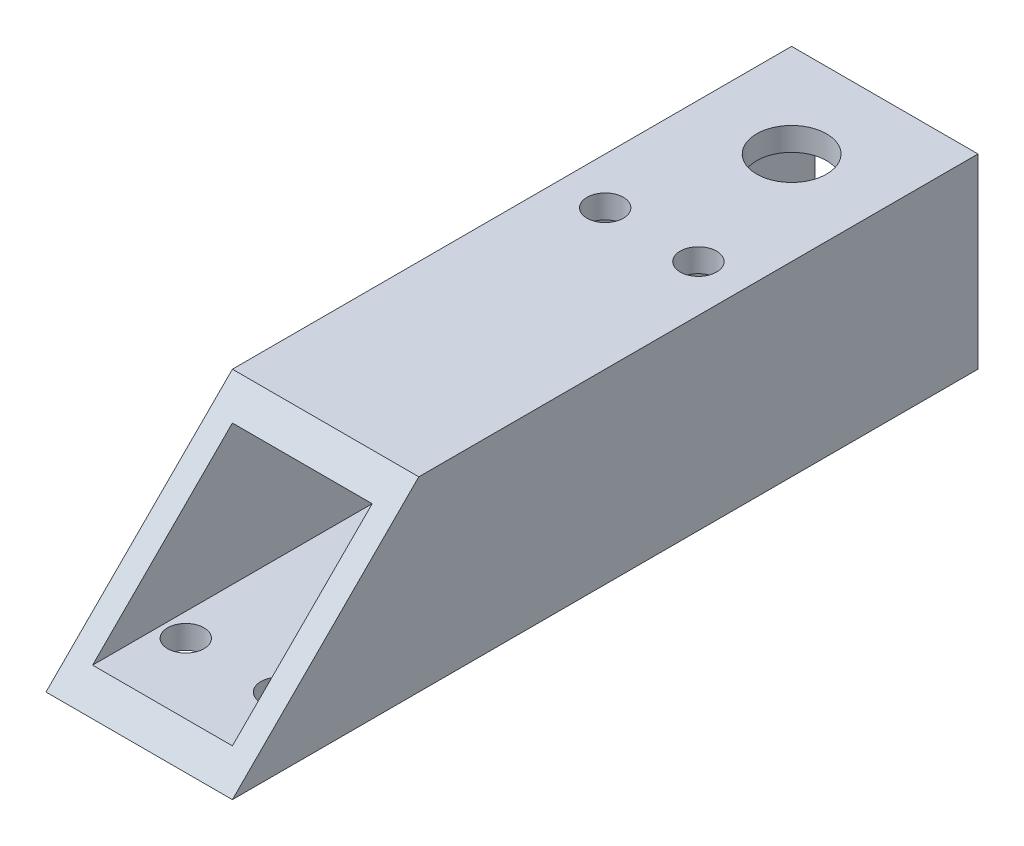
ISO-10303-21;
HEADER;
FILE_DESCRIPTION(('STEP AP214'),'2;1');
FILE_NAME('part.step','',(''),(''),'','','');
FILE_SCHEMA(('AUTOMOTIVE_DESIGN { 1 0 10303 214 1 1 1 1 }'));
ENDSEC;
DATA;
#1=APPLICATION_CONTEXT('core data for automotive mechanical design processes');
#2=APPLICATION_PROTOCOL_DEFINITION('international standard','automotive_design',2000,#1);
#3=PRODUCT_CONTEXT('',#1,'mechanical');
#4=PRODUCT('Part','Part','',(#3));
#5=PRODUCT_RELATED_PRODUCT_CATEGORY('part','',(#4));
#6=PRODUCT_DEFINITION_FORMATION('','',#4);
#7=PRODUCT_DEFINITION_CONTEXT('part definition',#1,'design');
#8=PRODUCT_DEFINITION('design','',#6,#7);
#9=PRODUCT_DEFINITION_SHAPE('','',#8);
#10=(LENGTH_UNIT() NAMED_UNIT(*) SI_UNIT(.MILLI.,.METRE.));
#11=(NAMED_UNIT(*) PLANE_ANGLE_UNIT() SI_UNIT($,.RADIAN.));
#12=(NAMED_UNIT(*) SI_UNIT($,.STERADIAN.) SOLID_ANGLE_UNIT());
#13=UNCERTAINTY_MEASURE_WITH_UNIT(LENGTH_MEASURE(1.E-05),#10,'distance_accuracy_value','');
#14=(GEOMETRIC_REPRESENTATION_CONTEXT(3) GLOBAL_UNCERTAINTY_ASSIGNED_CONTEXT((#13)) GLOBAL_UNIT_ASSIGNED_CONTEXT((#10,
#11,#12)) REPRESENTATION_CONTEXT('',''));
#15=CARTESIAN_POINT('',(0.,0.,0.));
#16=DIRECTION('',(0.,0.,1.));
#17=DIRECTION('',(1.,0.,0.));
#18=AXIS2_PLACEMENT_3D('',#15,#16,#17);
#19=CARTESIAN_POINT('',(-12.7,12.7,101.6));
#20=DIRECTION('',(0.,1.,0.));
#21=DIRECTION('',(0.,0.,1.));
#22=AXIS2_PLACEMENT_3D('',#19,#20,#21);
#23=PLANE('',#22);
#24=CARTESIAN_POINT('',(6.35,12.7,31.75));
#25=DIRECTION('',(0.,-1.,0.));
#26=DIRECTION('',(0.,0.,-1.));
#27=AXIS2_PLACEMENT_3D('',#24,#25,#26);
#28=CIRCLE('',#27,2.47650000000001);
#29=CARTESIAN_POINT('',(6.35,12.7,29.2735));
#30=VERTEX_POINT('',#29);
#31=EDGE_CURVE('E145',#30,#30,#28,.T.);
#32=ORIENTED_EDGE('',*,*,#31,.T.);
#33=EDGE_LOOP('',(#32));
#34=FACE_BOUND('',#33,.T.);
#35=CARTESIAN_POINT('',(-6.35,12.7,31.75));
#36=DIRECTION('',(0.,-1.,0.));
#37=DIRECTION('',(0.,0.,-1.));
#38=AXIS2_PLACEMENT_3D('',#35,#36,#37);
#39=CIRCLE('',#38,2.4765);
#40=CARTESIAN_POINT('',(-6.35,12.7,29.2735));
#41=VERTEX_POINT('',#40);
#42=EDGE_CURVE('E156',#41,#41,#39,.T.);
#43=ORIENTED_EDGE('',*,*,#42,.T.);
#44=EDGE_LOOP('',(#43));
#45=FACE_BOUND('',#44,.T.);
#46=CARTESIAN_POINT('',(0.,12.7,12.7));
#47=DIRECTION('',(0.,1.,0.));
#48=DIRECTION('',(0.,0.,1.));
#49=AXIS2_PLACEMENT_3D('',#46,#47,#48);
#50=CIRCLE('',#49,4.7625);
#51=CARTESIAN_POINT('',(0.,12.7,17.4625));
#52=VERTEX_POINT('',#51);
#53=EDGE_CURVE('E167',#52,#52,#50,.T.);
#54=ORIENTED_EDGE('',*,*,#53,.F.);
#55=EDGE_LOOP('',(#54));
#56=FACE_BOUND('',#55,.T.);
#57=DIRECTION('',(1.,0.,0.));
#58=VECTOR('',#57,1.);
#59=CARTESIAN_POINT('',(-12.7,12.7,76.2));
#60=LINE('',#59,#58);
#61=CARTESIAN_POINT('',(-12.7,12.7,76.2));
#62=VERTEX_POINT('',#61);
#63=CARTESIAN_POINT('',(12.7,12.7,76.2));
#64=VERTEX_POINT('',#63);
#65=EDGE_CURVE('E98',#62,#64,#60,.T.);
#66=ORIENTED_EDGE('',*,*,#65,.T.);
#67=DIRECTION('',(0.,0.,-1.));
#68=VECTOR('',#67,1.);
#69=CARTESIAN_POINT('',(12.7,12.7,101.6));
#70=LINE('',#69,#68);
#71=CARTESIAN_POINT('',(12.7,12.7,0.));
#72=VERTEX_POINT('',#71);
#73=EDGE_CURVE('E128',#64,#72,#70,.T.);
#74=ORIENTED_EDGE('',*,*,#73,.T.);
#75=DIRECTION('',(1.,0.,0.));
#76=VECTOR('',#75,1.);
#77=CARTESIAN_POINT('',(-12.7,12.7,0.));
#78=LINE('',#77,#76);
#79=CARTESIAN_POINT('',(-12.7,12.7,0.));
#80=VERTEX_POINT('',#79);
#81=EDGE_CURVE('E117',#80,#72,#78,.T.);
#82=ORIENTED_EDGE('',*,*,#81,.F.);
#83=DIRECTION('',(0.,0.,-1.));
#84=VECTOR('',#83,1.);
#85=CARTESIAN_POINT('',(-12.7,12.7,101.6));
#86=LINE('',#85,#84);
#87=EDGE_CURVE('E41',#62,#80,#86,.T.);
#88=ORIENTED_EDGE('',*,*,#87,.F.);
#89=EDGE_LOOP('',(#66,#74,#82,#88));
#90=FACE_BOUND('',#89,.T.);
#91=ADVANCED_FACE('F33',(#34,#45,#56,#90),#23,.T.);
#92=CARTESIAN_POINT('',(-12.7,-12.7,101.6));
#93=DIRECTION('',(-1.,0.,0.));
#94=DIRECTION('',(0.,0.,1.));
#95=AXIS2_PLACEMENT_3D('',#92,#93,#94);
#96=PLANE('',#95);
#97=DIRECTION('',(0.,0.707106781186547,-0.707106781186548));
#98=VECTOR('',#97,1.);
#99=CARTESIAN_POINT('',(-12.7,12.7,76.2));
#100=LINE('',#99,#98);
#101=CARTESIAN_POINT('',(-12.7,-12.7,101.6));
#102=VERTEX_POINT('',#101);
#103=EDGE_CURVE('E101',#102,#62,#100,.T.);
#104=ORIENTED_EDGE('',*,*,#103,.T.);
#105=ORIENTED_EDGE('',*,*,#87,.T.);
#106=DIRECTION('',(0.,1.,0.));
#107=VECTOR('',#106,1.);
#108=CARTESIAN_POINT('',(-12.7,-12.7,0.));
#109=LINE('',#108,#107);
#110=CARTESIAN_POINT('',(-12.7,-12.7,0.));
#111=VERTEX_POINT('',#110);
#112=EDGE_CURVE('E123',#111,#80,#109,.T.);
#113=ORIENTED_EDGE('',*,*,#112,.F.);
#114=DIRECTION('',(0.,0.,-1.));
#115=VECTOR('',#114,1.);
#116=CARTESIAN_POINT('',(-12.7,-12.7,101.6));
#117=LINE('',#116,#115);
#118=EDGE_CURVE('E113',#102,#111,#117,.T.);
#119=ORIENTED_EDGE('',*,*,#118,.F.);
#120=EDGE_LOOP('',(#104,#105,#113,#119));
#121=FACE_BOUND('',#120,.T.);
#122=ADVANCED_FACE('F110',(#121),#96,.T.);
#123=CARTESIAN_POINT('',(-12.7,-12.7,101.6));
#124=DIRECTION('',(0.,1.,0.));
#125=DIRECTION('',(0.,0.,1.));
#126=AXIS2_PLACEMENT_3D('',#123,#124,#125);
#127=PLANE('',#126);
#128=CARTESIAN_POINT('',(6.35,-12.7,31.75));
#129=DIRECTION('',(0.,-1.,0.));
#130=DIRECTION('',(0.,0.,-1.));
#131=AXIS2_PLACEMENT_3D('',#128,#129,#130);
#132=CIRCLE('',#131,2.47650000000001);
#133=CARTESIAN_POINT('',(6.35,-12.7,29.2735));
#134=VERTEX_POINT('',#133);
#135=EDGE_CURVE('E151',#134,#134,#132,.T.);
#136=ORIENTED_EDGE('',*,*,#135,.F.);
#137=EDGE_LOOP('',(#136));
#138=FACE_BOUND('',#137,.T.);
#139=CARTESIAN_POINT('',(-6.35,-12.7,31.75));
#140=DIRECTION('',(0.,-1.,0.));
#141=DIRECTION('',(0.,0.,-1.));
#142=AXIS2_PLACEMENT_3D('',#139,#140,#141);
#143=CIRCLE('',#142,2.4765);
#144=CARTESIAN_POINT('',(-6.35,-12.7,29.2735));
#145=VERTEX_POINT('',#144);
#146=EDGE_CURVE('E161',#145,#145,#143,.T.);
#147=ORIENTED_EDGE('',*,*,#146,.F.);
#148=EDGE_LOOP('',(#147));
#149=FACE_BOUND('',#148,.T.);
#150=CARTESIAN_POINT('',(0.,-12.7,12.7));
#151=DIRECTION('',(0.,1.,0.));
#152=DIRECTION('',(0.,0.,1.));
#153=AXIS2_PLACEMENT_3D('',#150,#151,#152);
#154=CIRCLE('',#153,4.7625);
#155=CARTESIAN_POINT('',(0.,-12.7,17.4625));
#156=VERTEX_POINT('',#155);
#157=EDGE_CURVE('E141',#156,#156,#154,.T.);
#158=ORIENTED_EDGE('',*,*,#157,.T.);
#159=EDGE_LOOP('',(#158));
#160=FACE_BOUND('',#159,.T.);
#161=CARTESIAN_POINT('',(-6.35,-12.7,88.9));
#162=DIRECTION('',(0.,-1.,0.));
#163=DIRECTION('',(0.,0.,-1.));
#164=AXIS2_PLACEMENT_3D('',#161,#162,#163);
#165=CIRCLE('',#164,2.4765);
#166=CARTESIAN_POINT('',(-6.35,-12.7,86.4235));
#167=VERTEX_POINT('',#166);
#168=EDGE_CURVE('E135',#167,#167,#165,.T.);
#169=ORIENTED_EDGE('',*,*,#168,.F.);
#170=EDGE_LOOP('',(#169));
#171=FACE_BOUND('',#170,.T.);
#172=CARTESIAN_POINT('',(6.35,-12.7,88.9));
#173=DIRECTION('',(0.,-1.,0.));
#174=DIRECTION('',(0.,0.,1.));
#175=AXIS2_PLACEMENT_3D('',#172,#173,#174);
#176=CIRCLE('',#175,2.4765);
#177=CARTESIAN_POINT('',(6.35,-12.7,91.3765));
#178=VERTEX_POINT('',#177);
#179=EDGE_CURVE('E174',#178,#178,#176,.T.);
#180=ORIENTED_EDGE('',*,*,#179,.F.);
#181=EDGE_LOOP('',(#180));
#182=FACE_BOUND('',#181,.T.);
#183=DIRECTION('',(1.,0.,0.));
#184=VECTOR('',#183,1.);
#185=CARTESIAN_POINT('',(-12.7,-12.7,0.));
#186=LINE('',#185,#184);
#187=CARTESIAN_POINT('',(12.7,-12.7,0.));
#188=VERTEX_POINT('',#187);
#189=EDGE_CURVE('E212',#111,#188,#186,.T.);
#190=ORIENTED_EDGE('',*,*,#189,.T.);
#191=DIRECTION('',(0.,0.,-1.));
#192=VECTOR('',#191,1.);
#193=CARTESIAN_POINT('',(12.7,-12.7,101.6));
#194=LINE('',#193,#192);
#195=CARTESIAN_POINT('',(12.7,-12.7,101.6));
#196=VERTEX_POINT('',#195);
#197=EDGE_CURVE('E120',#196,#188,#194,.T.);
#198=ORIENTED_EDGE('',*,*,#197,.F.);
#199=DIRECTION('',(1.,0.,0.));
#200=VECTOR('',#199,1.);
#201=CARTESIAN_POINT('',(-12.7,-12.7,101.6));
#202=LINE('',#201,#200);
#203=EDGE_CURVE('E129',#102,#196,#202,.T.);
#204=ORIENTED_EDGE('',*,*,#203,.F.);
#205=ORIENTED_EDGE('',*,*,#118,.T.);
#206=EDGE_LOOP('',(#190,#198,#204,#205));
#207=FACE_BOUND('',#206,.T.);
#208=ADVANCED_FACE('F221',(#138,#149,#160,#171,#182,#207),#127,.F.);
#209=CARTESIAN_POINT('',(12.7,-12.7,101.6));
#210=DIRECTION('',(-1.,0.,0.));
#211=DIRECTION('',(0.,0.,1.));
#212=AXIS2_PLACEMENT_3D('',#209,#210,#211);
#213=PLANE('',#212);
#214=ORIENTED_EDGE('',*,*,#73,.F.);
#215=DIRECTION('',(0.,0.707106781186547,-0.707106781186548));
#216=VECTOR('',#215,1.);
#217=CARTESIAN_POINT('',(12.7,12.7,76.2));
#218=LINE('',#217,#216);
#219=EDGE_CURVE('E104',#196,#64,#218,.T.);
#220=ORIENTED_EDGE('',*,*,#219,.F.);
#221=ORIENTED_EDGE('',*,*,#197,.T.);
#222=DIRECTION('',(0.,1.,0.));
#223=VECTOR('',#222,1.);
#224=CARTESIAN_POINT('',(12.7,-12.7,0.));
#225=LINE('',#224,#223);
#226=EDGE_CURVE('E210',#188,#72,#225,.T.);
#227=ORIENTED_EDGE('',*,*,#226,.T.);
#228=EDGE_LOOP('',(#214,#220,#221,#227));
#229=FACE_BOUND('',#228,.T.);
#230=ADVANCED_FACE('F220',(#229),#213,.F.);
#231=CARTESIAN_POINT('',(0.,0.,0.));
#232=DIRECTION('',(0.,0.,1.));
#233=DIRECTION('',(1.,0.,0.));
#234=AXIS2_PLACEMENT_3D('',#231,#232,#233);
#235=PLANE('',#234);
#236=DIRECTION('',(1.,0.,0.));
#237=VECTOR('',#236,1.);
#238=CARTESIAN_POINT('',(-9.525,-9.525,0.));
#239=LINE('',#238,#237);
#240=CARTESIAN_POINT('',(-9.525,-9.525,0.));
#241=VERTEX_POINT('',#240);
#242=CARTESIAN_POINT('',(9.525,-9.525,0.));
#243=VERTEX_POINT('',#242);
#244=EDGE_CURVE('E194',#241,#243,#239,.T.);
#245=ORIENTED_EDGE('',*,*,#244,.T.);
#246=DIRECTION('',(0.,1.,0.));
#247=VECTOR('',#246,1.);
#248=CARTESIAN_POINT('',(9.525,-9.525,0.));
#249=LINE('',#248,#247);
#250=CARTESIAN_POINT('',(9.525,9.525,0.));
#251=VERTEX_POINT('',#250);
#252=EDGE_CURVE('E187',#243,#251,#249,.T.);
#253=ORIENTED_EDGE('',*,*,#252,.T.);
#254=DIRECTION('',(-1.,0.,0.));
#255=VECTOR('',#254,1.);
#256=CARTESIAN_POINT('',(-9.525,9.525,0.));
#257=LINE('',#256,#255);
#258=CARTESIAN_POINT('',(-9.525,9.525,0.));
#259=VERTEX_POINT('',#258);
#260=EDGE_CURVE('E190',#251,#259,#257,.T.);
#261=ORIENTED_EDGE('',*,*,#260,.T.);
#262=DIRECTION('',(0.,-1.,0.));
#263=VECTOR('',#262,1.);
#264=CARTESIAN_POINT('',(-9.525,-9.525,0.));
#265=LINE('',#264,#263);
#266=EDGE_CURVE('E56',#259,#241,#265,.T.);
#267=ORIENTED_EDGE('',*,*,#266,.T.);
#268=EDGE_LOOP('',(#245,#253,#261,#267));
#269=FACE_BOUND('',#268,.T.);
#270=ORIENTED_EDGE('',*,*,#81,.T.);
#271=ORIENTED_EDGE('',*,*,#226,.F.);
#272=ORIENTED_EDGE('',*,*,#189,.F.);
#273=ORIENTED_EDGE('',*,*,#112,.T.);
#274=EDGE_LOOP('',(#270,#271,#272,#273));
#275=FACE_BOUND('',#274,.T.);
#276=ADVANCED_FACE('F217',(#269,#275),#235,.F.);
#277=CARTESIAN_POINT('',(9.525,-9.525,0.));
#278=DIRECTION('',(1.,0.,0.));
#279=DIRECTION('',(0.,0.,-1.));
#280=AXIS2_PLACEMENT_3D('',#277,#278,#279);
#281=PLANE('',#280);
#282=DIRECTION('',(0.,0.,1.));
#283=VECTOR('',#282,1.);
#284=CARTESIAN_POINT('',(9.525,-9.525,0.));
#285=LINE('',#284,#283);
#286=CARTESIAN_POINT('',(9.525,-9.525,98.425));
#287=VERTEX_POINT('',#286);
#288=EDGE_CURVE('E198',#243,#287,#285,.T.);
#289=ORIENTED_EDGE('',*,*,#288,.T.);
#290=DIRECTION('',(0.,0.707106781186547,-0.707106781186548));
#291=VECTOR('',#290,1.);
#292=CARTESIAN_POINT('',(9.525,39.6875,49.2125));
#293=LINE('',#292,#291);
#294=CARTESIAN_POINT('',(9.525,9.525,79.375));
#295=VERTEX_POINT('',#294);
#296=EDGE_CURVE('E184',#287,#295,#293,.T.);
#297=ORIENTED_EDGE('',*,*,#296,.T.);
#298=DIRECTION('',(0.,0.,1.));
#299=VECTOR('',#298,1.);
#300=CARTESIAN_POINT('',(9.525,9.525,0.));
#301=LINE('',#300,#299);
#302=EDGE_CURVE('E197',#251,#295,#301,.T.);
#303=ORIENTED_EDGE('',*,*,#302,.F.);
#304=ORIENTED_EDGE('',*,*,#252,.F.);
#305=EDGE_LOOP('',(#289,#297,#303,#304));
#306=FACE_BOUND('',#305,.T.);
#307=ADVANCED_FACE('F257',(#306),#281,.F.);
#308=CARTESIAN_POINT('',(-9.525,-9.525,0.));
#309=DIRECTION('',(0.,-1.,0.));
#310=DIRECTION('',(0.,0.,-1.));
#311=AXIS2_PLACEMENT_3D('',#308,#309,#310);
#312=PLANE('',#311);
#313=CARTESIAN_POINT('',(6.35,-9.525,31.75));
#314=DIRECTION('',(0.,-1.,0.));
#315=DIRECTION('',(0.,0.,-1.));
#316=AXIS2_PLACEMENT_3D('',#313,#314,#315);
#317=CIRCLE('',#316,2.47650000000001);
#318=CARTESIAN_POINT('',(6.35,-9.525,29.2735));
#319=VERTEX_POINT('',#318);
#320=EDGE_CURVE('E164',#319,#319,#317,.T.);
#321=ORIENTED_EDGE('',*,*,#320,.T.);
#322=EDGE_LOOP('',(#321));
#323=FACE_BOUND('',#322,.T.);
#324=CARTESIAN_POINT('',(-6.35,-9.525,31.75));
#325=DIRECTION('',(0.,-1.,0.));
#326=DIRECTION('',(0.,0.,-1.));
#327=AXIS2_PLACEMENT_3D('',#324,#325,#326);
#328=CIRCLE('',#327,2.4765);
#329=CARTESIAN_POINT('',(-6.35,-9.525,29.2735));
#330=VERTEX_POINT('',#329);
#331=EDGE_CURVE('E144',#330,#330,#328,.T.);
#332=ORIENTED_EDGE('',*,*,#331,.T.);
#333=EDGE_LOOP('',(#332));
#334=FACE_BOUND('',#333,.T.);
#335=CARTESIAN_POINT('',(0.,-9.525,12.7));
#336=DIRECTION('',(0.,-1.,0.));
#337=DIRECTION('',(0.,0.,-1.));
#338=AXIS2_PLACEMENT_3D('',#335,#336,#337);
#339=CIRCLE('',#338,4.7625);
#340=CARTESIAN_POINT('',(0.,-9.525,7.9375));
#341=VERTEX_POINT('',#340);
#342=EDGE_CURVE('E140',#341,#341,#339,.T.);
#343=ORIENTED_EDGE('',*,*,#342,.T.);
#344=EDGE_LOOP('',(#343));
#345=FACE_BOUND('',#344,.T.);
#346=CARTESIAN_POINT('',(-6.35,-9.525,88.9));
#347=DIRECTION('',(0.,-1.,0.));
#348=DIRECTION('',(0.,0.,-1.));
#349=AXIS2_PLACEMENT_3D('',#346,#347,#348);
#350=CIRCLE('',#349,2.4765);
#351=CARTESIAN_POINT('',(-6.35,-9.525,86.4235));
#352=VERTEX_POINT('',#351);
#353=EDGE_CURVE('E134',#352,#352,#350,.T.);
#354=ORIENTED_EDGE('',*,*,#353,.T.);
#355=EDGE_LOOP('',(#354));
#356=FACE_BOUND('',#355,.T.);
#357=CARTESIAN_POINT('',(6.35,-9.525,88.9));
#358=DIRECTION('',(0.,-1.,0.));
#359=DIRECTION('',(0.,0.,-1.));
#360=AXIS2_PLACEMENT_3D('',#357,#358,#359);
#361=CIRCLE('',#360,2.4765);
#362=CARTESIAN_POINT('',(6.35,-9.525,86.4235));
#363=VERTEX_POINT('',#362);
#364=EDGE_CURVE('E131',#363,#363,#361,.T.);
#365=ORIENTED_EDGE('',*,*,#364,.T.);
#366=EDGE_LOOP('',(#365));
#367=FACE_BOUND('',#366,.T.);
#368=DIRECTION('',(0.,0.,1.));
#369=VECTOR('',#368,1.);
#370=CARTESIAN_POINT('',(-9.525,-9.525,0.));
#371=LINE('',#370,#369);
#372=CARTESIAN_POINT('',(-9.525,-9.52500000000001,98.425));
#373=VERTEX_POINT('',#372);
#374=EDGE_CURVE('E201',#241,#373,#371,.T.);
#375=ORIENTED_EDGE('',*,*,#374,.T.);
#376=DIRECTION('',(1.,0.,0.));
#377=VECTOR('',#376,1.);
#378=CARTESIAN_POINT('',(-9.525,-9.525,98.425));
#379=LINE('',#378,#377);
#380=EDGE_CURVE('E181',#373,#287,#379,.T.);
#381=ORIENTED_EDGE('',*,*,#380,.T.);
#382=ORIENTED_EDGE('',*,*,#288,.F.);
#383=ORIENTED_EDGE('',*,*,#244,.F.);
#384=EDGE_LOOP('',(#375,#381,#382,#383));
#385=FACE_BOUND('',#384,.T.);
#386=ADVANCED_FACE('F259',(#323,#334,#345,#356,#367,#385),#312,.F.);
#387=CARTESIAN_POINT('',(-9.525,-9.525,0.));
#388=DIRECTION('',(-1.,0.,0.));
#389=DIRECTION('',(0.,0.,1.));
#390=AXIS2_PLACEMENT_3D('',#387,#388,#389);
#391=PLANE('',#390);
#392=DIRECTION('',(0.,0.,1.));
#393=VECTOR('',#392,1.);
#394=CARTESIAN_POINT('',(-9.525,9.525,0.));
#395=LINE('',#394,#393);
#396=CARTESIAN_POINT('',(-9.525,9.525,79.375));
#397=VERTEX_POINT('',#396);
#398=EDGE_CURVE('E204',#259,#397,#395,.T.);
#399=ORIENTED_EDGE('',*,*,#398,.T.);
#400=DIRECTION('',(0.,-0.707106781186547,0.707106781186548));
#401=VECTOR('',#400,1.);
#402=CARTESIAN_POINT('',(-9.525,39.6875,49.2125));
#403=LINE('',#402,#401);
#404=EDGE_CURVE('E49',#397,#373,#403,.T.);
#405=ORIENTED_EDGE('',*,*,#404,.T.);
#406=ORIENTED_EDGE('',*,*,#374,.F.);
#407=ORIENTED_EDGE('',*,*,#266,.F.);
#408=EDGE_LOOP('',(#399,#405,#406,#407));
#409=FACE_BOUND('',#408,.T.);
#410=ADVANCED_FACE('F251',(#409),#391,.F.);
#411=CARTESIAN_POINT('',(-9.525,9.525,0.));
#412=DIRECTION('',(0.,1.,0.));
#413=DIRECTION('',(0.,0.,1.));
#414=AXIS2_PLACEMENT_3D('',#411,#412,#413);
#415=PLANE('',#414);
#416=CARTESIAN_POINT('',(6.35,9.525,31.75));
#417=DIRECTION('',(0.,1.,0.));
#418=DIRECTION('',(0.,0.,1.));
#419=AXIS2_PLACEMENT_3D('',#416,#417,#418);
#420=CIRCLE('',#419,2.47650000000001);
#421=CARTESIAN_POINT('',(6.35,9.525,34.2265));
#422=VERTEX_POINT('',#421);
#423=EDGE_CURVE('E36',#422,#422,#420,.T.);
#424=ORIENTED_EDGE('',*,*,#423,.T.);
#425=EDGE_LOOP('',(#424));
#426=FACE_BOUND('',#425,.T.);
#427=CARTESIAN_POINT('',(-6.35,9.525,31.75));
#428=DIRECTION('',(0.,1.,0.));
#429=DIRECTION('',(0.,0.,1.));
#430=AXIS2_PLACEMENT_3D('',#427,#428,#429);
#431=CIRCLE('',#430,2.4765);
#432=CARTESIAN_POINT('',(-6.35,9.525,34.2265));
#433=VERTEX_POINT('',#432);
#434=EDGE_CURVE('E142',#433,#433,#431,.T.);
#435=ORIENTED_EDGE('',*,*,#434,.T.);
#436=EDGE_LOOP('',(#435));
#437=FACE_BOUND('',#436,.T.);
#438=CARTESIAN_POINT('',(0.,9.525,12.7));
#439=DIRECTION('',(0.,1.,0.));
#440=DIRECTION('',(0.,0.,1.));
#441=AXIS2_PLACEMENT_3D('',#438,#439,#440);
#442=CIRCLE('',#441,4.7625);
#443=CARTESIAN_POINT('',(0.,9.525,17.4625));
#444=VERTEX_POINT('',#443);
#445=EDGE_CURVE('E138',#444,#444,#442,.T.);
#446=ORIENTED_EDGE('',*,*,#445,.T.);
#447=EDGE_LOOP('',(#446));
#448=FACE_BOUND('',#447,.T.);
#449=ORIENTED_EDGE('',*,*,#302,.T.);
#450=DIRECTION('',(-1.,0.,0.));
#451=VECTOR('',#450,1.);
#452=CARTESIAN_POINT('',(-9.525,9.525,79.375));
#453=LINE('',#452,#451);
#454=EDGE_CURVE('E11',#295,#397,#453,.T.);
#455=ORIENTED_EDGE('',*,*,#454,.T.);
#456=ORIENTED_EDGE('',*,*,#398,.F.);
#457=ORIENTED_EDGE('',*,*,#260,.F.);
#458=EDGE_LOOP('',(#449,#455,#456,#457));
#459=FACE_BOUND('',#458,.T.);
#460=ADVANCED_FACE('F248',(#426,#437,#448,#459),#415,.F.);
#461=CARTESIAN_POINT('',(-12.7,12.7,76.2));
#462=DIRECTION('',(0.,-0.707106781186548,-0.707106781186547));
#463=DIRECTION('',(0.,0.707106781186547,-0.707106781186548));
#464=AXIS2_PLACEMENT_3D('',#461,#462,#463);
#465=PLANE('',#464);
#466=ORIENTED_EDGE('',*,*,#219,.T.);
#467=ORIENTED_EDGE('',*,*,#65,.F.);
#468=ORIENTED_EDGE('',*,*,#103,.F.);
#469=ORIENTED_EDGE('',*,*,#203,.T.);
#470=EDGE_LOOP('',(#466,#467,#468,#469));
#471=FACE_BOUND('',#470,.T.);
#472=ORIENTED_EDGE('',*,*,#380,.F.);
#473=ORIENTED_EDGE('',*,*,#404,.F.);
#474=ORIENTED_EDGE('',*,*,#454,.F.);
#475=ORIENTED_EDGE('',*,*,#296,.F.);
#476=EDGE_LOOP('',(#472,#473,#474,#475));
#477=FACE_BOUND('',#476,.T.);
#478=ADVANCED_FACE('F100',(#471,#477),#465,.F.);
#479=CARTESIAN_POINT('',(6.35,12.7,88.9));
#480=DIRECTION('',(0.,-1.,0.));
#481=DIRECTION('',(0.,0.,-1.));
#482=AXIS2_PLACEMENT_3D('',#479,#480,#481);
#483=CYLINDRICAL_SURFACE('',#482,2.4765);
#484=ORIENTED_EDGE('',*,*,#179,.T.);
#485=EDGE_LOOP('',(#484));
#486=FACE_BOUND('',#485,.T.);
#487=ORIENTED_EDGE('',*,*,#364,.F.);
#488=EDGE_LOOP('',(#487));
#489=FACE_BOUND('',#488,.T.);
#490=ADVANCED_FACE('F276',(#486,#489),#483,.F.);
#491=CARTESIAN_POINT('',(-6.35,12.7,88.9));
#492=DIRECTION('',(0.,-1.,0.));
#493=DIRECTION('',(0.,0.,-1.));
#494=AXIS2_PLACEMENT_3D('',#491,#492,#493);
#495=CYLINDRICAL_SURFACE('',#494,2.4765);
#496=ORIENTED_EDGE('',*,*,#168,.T.);
#497=EDGE_LOOP('',(#496));
#498=FACE_BOUND('',#497,.T.);
#499=ORIENTED_EDGE('',*,*,#353,.F.);
#500=EDGE_LOOP('',(#499));
#501=FACE_BOUND('',#500,.T.);
#502=ADVANCED_FACE('F244',(#498,#501),#495,.F.);
#503=CARTESIAN_POINT('',(0.,-12.7,12.7));
#504=DIRECTION('',(0.,1.,0.));
#505=DIRECTION('',(0.,0.,1.));
#506=AXIS2_PLACEMENT_3D('',#503,#504,#505);
#507=CYLINDRICAL_SURFACE('',#506,4.7625);
#508=ORIENTED_EDGE('',*,*,#53,.T.);
#509=EDGE_LOOP('',(#508));
#510=FACE_BOUND('',#509,.T.);
#511=ORIENTED_EDGE('',*,*,#445,.F.);
#512=EDGE_LOOP('',(#511));
#513=FACE_BOUND('',#512,.T.);
#514=ADVANCED_FACE('F240',(#510,#513),#507,.F.);
#515=ORIENTED_EDGE('',*,*,#157,.F.);
#516=EDGE_LOOP('',(#515));
#517=FACE_BOUND('',#516,.T.);
#518=ORIENTED_EDGE('',*,*,#342,.F.);
#519=EDGE_LOOP('',(#518));
#520=FACE_BOUND('',#519,.T.);
#521=ADVANCED_FACE('F243',(#517,#520),#507,.F.);
#522=CARTESIAN_POINT('',(-6.35,12.7,31.75));
#523=DIRECTION('',(0.,-1.,0.));
#524=DIRECTION('',(0.,0.,-1.));
#525=AXIS2_PLACEMENT_3D('',#522,#523,#524);
#526=CYLINDRICAL_SURFACE('',#525,2.4765);
#527=ORIENTED_EDGE('',*,*,#42,.F.);
#528=EDGE_LOOP('',(#527));
#529=FACE_BOUND('',#528,.T.);
#530=ORIENTED_EDGE('',*,*,#434,.F.);
#531=EDGE_LOOP('',(#530));
#532=FACE_BOUND('',#531,.T.);
#533=ADVANCED_FACE('F284',(#529,#532),#526,.F.);
#534=CARTESIAN_POINT('',(6.35,12.7,31.75));
#535=DIRECTION('',(0.,-1.,0.));
#536=DIRECTION('',(0.,0.,-1.));
#537=AXIS2_PLACEMENT_3D('',#534,#535,#536);
#538=CYLINDRICAL_SURFACE('',#537,2.47650000000001);
#539=ORIENTED_EDGE('',*,*,#31,.F.);
#540=EDGE_LOOP('',(#539));
#541=FACE_BOUND('',#540,.T.);
#542=ORIENTED_EDGE('',*,*,#423,.F.);
#543=EDGE_LOOP('',(#542));
#544=FACE_BOUND('',#543,.T.);
#545=ADVANCED_FACE('F290',(#541,#544),#538,.F.);
#546=ORIENTED_EDGE('',*,*,#146,.T.);
#547=EDGE_LOOP('',(#546));
#548=FACE_BOUND('',#547,.T.);
#549=ORIENTED_EDGE('',*,*,#331,.F.);
#550=EDGE_LOOP('',(#549));
#551=FACE_BOUND('',#550,.T.);
#552=ADVANCED_FACE('F286',(#548,#551),#526,.F.);
#553=ORIENTED_EDGE('',*,*,#135,.T.);
#554=EDGE_LOOP('',(#553));
#555=FACE_BOUND('',#554,.T.);
#556=ORIENTED_EDGE('',*,*,#320,.F.);
#557=EDGE_LOOP('',(#556));
#558=FACE_BOUND('',#557,.T.);
#559=ADVANCED_FACE('F289',(#555,#558),#538,.F.);
#560=CLOSED_SHELL('',(#91,#122,#208,#230,#276,#307,#386,#410,#460,#478,#490,#502,#514,#521,#533,
#545,#552,#559));
#561=MANIFOLD_SOLID_BREP('B2',#560);
#562=ADVANCED_BREP_SHAPE_REPRESENTATION('',(#18,#561),#14);
#563=SHAPE_DEFINITION_REPRESENTATION(#9,#562);
ENDSEC;
END-ISO-10303-21;
